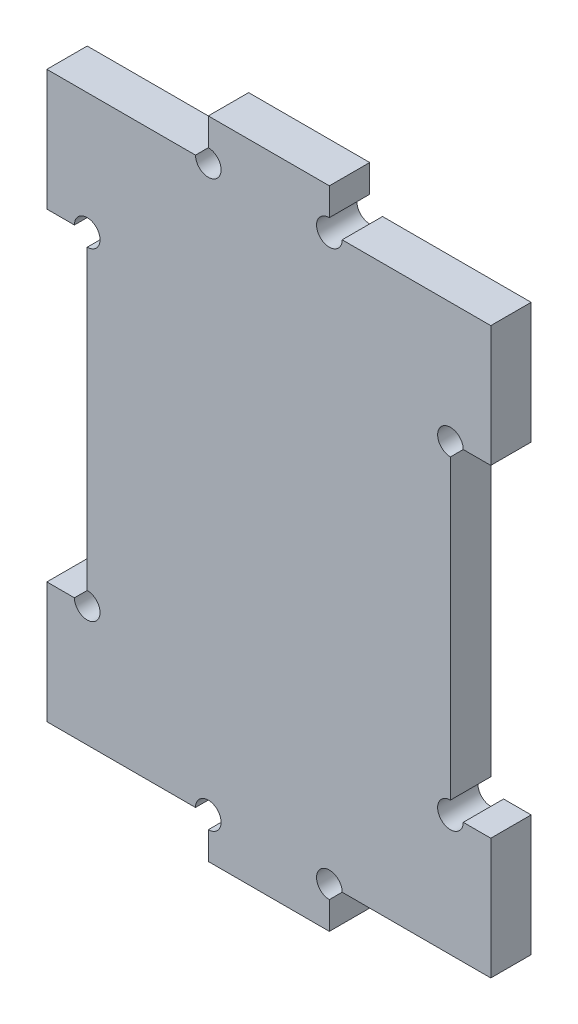
ISO-10303-21;
HEADER;
FILE_DESCRIPTION(('STEP AP214'),'2;1');
FILE_NAME('part.step','',(''),(''),'','','');
FILE_SCHEMA(('AUTOMOTIVE_DESIGN { 1 0 10303 214 1 1 1 1 }'));
ENDSEC;
DATA;
#1=APPLICATION_CONTEXT('core data for automotive mechanical design processes');
#2=APPLICATION_PROTOCOL_DEFINITION('international standard','automotive_design',2000,#1);
#3=PRODUCT_CONTEXT('',#1,'mechanical');
#4=PRODUCT('Part','Part','',(#3));
#5=PRODUCT_RELATED_PRODUCT_CATEGORY('part','',(#4));
#6=PRODUCT_DEFINITION_FORMATION('','',#4);
#7=PRODUCT_DEFINITION_CONTEXT('part definition',#1,'design');
#8=PRODUCT_DEFINITION('design','',#6,#7);
#9=PRODUCT_DEFINITION_SHAPE('','',#8);
#10=(LENGTH_UNIT() NAMED_UNIT(*) SI_UNIT(.MILLI.,.METRE.));
#11=(NAMED_UNIT(*) PLANE_ANGLE_UNIT() SI_UNIT($,.RADIAN.));
#12=(NAMED_UNIT(*) SI_UNIT($,.STERADIAN.) SOLID_ANGLE_UNIT());
#13=UNCERTAINTY_MEASURE_WITH_UNIT(LENGTH_MEASURE(1.E-05),#10,'distance_accuracy_value','');
#14=(GEOMETRIC_REPRESENTATION_CONTEXT(3) GLOBAL_UNCERTAINTY_ASSIGNED_CONTEXT((#13)) GLOBAL_UNIT_ASSIGNED_CONTEXT((#10,
#11,#12)) REPRESENTATION_CONTEXT('',''));
#15=CARTESIAN_POINT('',(0.,0.,0.));
#16=DIRECTION('',(0.,0.,1.));
#17=DIRECTION('',(1.,0.,0.));
#18=AXIS2_PLACEMENT_3D('',#15,#16,#17);
#19=CARTESIAN_POINT('',(27.5,35.,5.));
#20=DIRECTION('',(-1.,0.,0.));
#21=DIRECTION('',(0.,0.,1.));
#22=AXIS2_PLACEMENT_3D('',#19,#20,#21);
#23=PLANE('',#22);
#24=DIRECTION('',(0.,0.,1.));
#25=VECTOR('',#24,1.);
#26=CARTESIAN_POINT('',(27.5,-20.,0.));
#27=LINE('',#26,#25);
#28=CARTESIAN_POINT('',(27.5,-20.,0.));
#29=VERTEX_POINT('',#28);
#30=CARTESIAN_POINT('',(27.5,-20.,5.));
#31=VERTEX_POINT('',#30);
#32=EDGE_CURVE('E270',#29,#31,#27,.T.);
#33=ORIENTED_EDGE('',*,*,#32,.T.);
#34=DIRECTION('',(0.,1.,0.));
#35=VECTOR('',#34,1.);
#36=CARTESIAN_POINT('',(27.5,35.,5.));
#37=LINE('',#36,#35);
#38=CARTESIAN_POINT('',(27.5,-35.,5.));
#39=VERTEX_POINT('',#38);
#40=EDGE_CURVE('E343',#39,#31,#37,.T.);
#41=ORIENTED_EDGE('',*,*,#40,.F.);
#42=DIRECTION('',(0.,0.,-1.));
#43=VECTOR('',#42,1.);
#44=CARTESIAN_POINT('',(27.5,-35.,5.));
#45=LINE('',#44,#43);
#46=CARTESIAN_POINT('',(27.5,-35.,0.));
#47=VERTEX_POINT('',#46);
#48=EDGE_CURVE('E397',#39,#47,#45,.T.);
#49=ORIENTED_EDGE('',*,*,#48,.T.);
#50=DIRECTION('',(0.,1.,0.));
#51=VECTOR('',#50,1.);
#52=CARTESIAN_POINT('',(27.5,35.,0.));
#53=LINE('',#52,#51);
#54=EDGE_CURVE('E387',#47,#29,#53,.T.);
#55=ORIENTED_EDGE('',*,*,#54,.T.);
#56=EDGE_LOOP('',(#33,#41,#49,#55));
#57=FACE_BOUND('',#56,.T.);
#58=ADVANCED_FACE('F38',(#57),#23,.F.);
#59=DIRECTION('',(0.,0.,1.));
#60=VECTOR('',#59,1.);
#61=CARTESIAN_POINT('',(27.5,20.,0.));
#62=LINE('',#61,#60);
#63=CARTESIAN_POINT('',(27.5,20.,0.));
#64=VERTEX_POINT('',#63);
#65=CARTESIAN_POINT('',(27.5,20.,5.));
#66=VERTEX_POINT('',#65);
#67=EDGE_CURVE('E250',#64,#66,#62,.T.);
#68=ORIENTED_EDGE('',*,*,#67,.F.);
#69=CARTESIAN_POINT('',(27.5,35.,0.));
#70=VERTEX_POINT('',#69);
#71=EDGE_CURVE('E386',#64,#70,#53,.T.);
#72=ORIENTED_EDGE('',*,*,#71,.T.);
#73=DIRECTION('',(0.,0.,-1.));
#74=VECTOR('',#73,1.);
#75=CARTESIAN_POINT('',(27.5,35.,5.));
#76=LINE('',#75,#74);
#77=CARTESIAN_POINT('',(27.5,35.,5.));
#78=VERTEX_POINT('',#77);
#79=EDGE_CURVE('E351',#78,#70,#76,.T.);
#80=ORIENTED_EDGE('',*,*,#79,.F.);
#81=EDGE_CURVE('E342',#66,#78,#37,.T.);
#82=ORIENTED_EDGE('',*,*,#81,.F.);
#83=EDGE_LOOP('',(#68,#72,#80,#82));
#84=FACE_BOUND('',#83,.T.);
#85=ADVANCED_FACE('F572',(#84),#23,.F.);
#86=CARTESIAN_POINT('',(0.,0.,5.));
#87=DIRECTION('',(0.,0.,1.));
#88=DIRECTION('',(1.,0.,0.));
#89=AXIS2_PLACEMENT_3D('',#86,#87,#88);
#90=PLANE('',#89);
#91=CARTESIAN_POINT('',(-7.5,35.,5.));
#92=DIRECTION('',(0.,0.,1.));
#93=DIRECTION('',(1.,0.,0.));
#94=AXIS2_PLACEMENT_3D('',#91,#92,#93);
#95=CIRCLE('',#94,1.5875);
#96=CARTESIAN_POINT('',(-9.0875,35.,5.));
#97=VERTEX_POINT('',#96);
#98=CARTESIAN_POINT('',(-7.5,36.5875,5.));
#99=VERTEX_POINT('',#98);
#100=EDGE_CURVE('E486',#97,#99,#95,.T.);
#101=ORIENTED_EDGE('',*,*,#100,.F.);
#102=DIRECTION('',(-1.,0.,0.));
#103=VECTOR('',#102,1.);
#104=CARTESIAN_POINT('',(-7.5,35.,5.));
#105=LINE('',#104,#103);
#106=CARTESIAN_POINT('',(-27.5,35.,5.));
#107=VERTEX_POINT('',#106);
#108=EDGE_CURVE('E317',#97,#107,#105,.T.);
#109=ORIENTED_EDGE('',*,*,#108,.T.);
#110=DIRECTION('',(0.,-1.,0.));
#111=VECTOR('',#110,1.);
#112=CARTESIAN_POINT('',(-27.5,35.,5.));
#113=LINE('',#112,#111);
#114=CARTESIAN_POINT('',(-27.5,20.,5.));
#115=VERTEX_POINT('',#114);
#116=EDGE_CURVE('E321',#107,#115,#113,.T.);
#117=ORIENTED_EDGE('',*,*,#116,.T.);
#118=DIRECTION('',(-1.,0.,0.));
#119=VECTOR('',#118,1.);
#120=CARTESIAN_POINT('',(-22.5,20.,5.));
#121=LINE('',#120,#119);
#122=CARTESIAN_POINT('',(-24.0875,20.,5.));
#123=VERTEX_POINT('',#122);
#124=EDGE_CURVE('E282',#123,#115,#121,.T.);
#125=ORIENTED_EDGE('',*,*,#124,.F.);
#126=CARTESIAN_POINT('',(-22.5,20.,5.));
#127=DIRECTION('',(0.,0.,1.));
#128=DIRECTION('',(1.,0.,0.));
#129=AXIS2_PLACEMENT_3D('',#126,#127,#128);
#130=CIRCLE('',#129,1.5875);
#131=CARTESIAN_POINT('',(-22.5,18.4125,5.));
#132=VERTEX_POINT('',#131);
#133=EDGE_CURVE('E485',#132,#123,#130,.T.);
#134=ORIENTED_EDGE('',*,*,#133,.F.);
#135=DIRECTION('',(0.,1.,0.));
#136=VECTOR('',#135,1.);
#137=CARTESIAN_POINT('',(-22.5,-20.,5.));
#138=LINE('',#137,#136);
#139=CARTESIAN_POINT('',(-22.5,-18.4125,5.));
#140=VERTEX_POINT('',#139);
#141=EDGE_CURVE('E293',#140,#132,#138,.T.);
#142=ORIENTED_EDGE('',*,*,#141,.F.);
#143=CARTESIAN_POINT('',(-22.5,-20.,5.));
#144=DIRECTION('',(0.,0.,1.));
#145=DIRECTION('',(1.,0.,0.));
#146=AXIS2_PLACEMENT_3D('',#143,#144,#145);
#147=CIRCLE('',#146,1.5875);
#148=CARTESIAN_POINT('',(-24.0875,-20.,5.));
#149=VERTEX_POINT('',#148);
#150=EDGE_CURVE('E477',#149,#140,#147,.T.);
#151=ORIENTED_EDGE('',*,*,#150,.F.);
#152=DIRECTION('',(1.,0.,0.));
#153=VECTOR('',#152,1.);
#154=CARTESIAN_POINT('',(-22.5,-20.,5.));
#155=LINE('',#154,#153);
#156=CARTESIAN_POINT('',(-27.5,-20.,5.));
#157=VERTEX_POINT('',#156);
#158=EDGE_CURVE('E274',#157,#149,#155,.T.);
#159=ORIENTED_EDGE('',*,*,#158,.F.);
#160=CARTESIAN_POINT('',(-27.5,-35.,5.));
#161=VERTEX_POINT('',#160);
#162=EDGE_CURVE('E320',#157,#161,#113,.T.);
#163=ORIENTED_EDGE('',*,*,#162,.T.);
#164=DIRECTION('',(1.,0.,0.));
#165=VECTOR('',#164,1.);
#166=CARTESIAN_POINT('',(-7.5,-35.,5.));
#167=LINE('',#166,#165);
#168=CARTESIAN_POINT('',(-9.0875,-35.,5.));
#169=VERTEX_POINT('',#168);
#170=EDGE_CURVE('E325',#161,#169,#167,.T.);
#171=ORIENTED_EDGE('',*,*,#170,.T.);
#172=CARTESIAN_POINT('',(-7.5,-35.,5.));
#173=DIRECTION('',(0.,0.,1.));
#174=DIRECTION('',(1.,0.,0.));
#175=AXIS2_PLACEMENT_3D('',#172,#173,#174);
#176=CIRCLE('',#175,1.5875);
#177=CARTESIAN_POINT('',(-7.5,-36.5875,5.));
#178=VERTEX_POINT('',#177);
#179=EDGE_CURVE('E467',#178,#169,#176,.T.);
#180=ORIENTED_EDGE('',*,*,#179,.F.);
#181=DIRECTION('',(0.,-1.,0.));
#182=VECTOR('',#181,1.);
#183=CARTESIAN_POINT('',(-7.5,-40.,5.));
#184=LINE('',#183,#182);
#185=CARTESIAN_POINT('',(-7.5,-40.,5.));
#186=VERTEX_POINT('',#185);
#187=EDGE_CURVE('E329',#178,#186,#184,.T.);
#188=ORIENTED_EDGE('',*,*,#187,.T.);
#189=DIRECTION('',(1.,0.,0.));
#190=VECTOR('',#189,1.);
#191=CARTESIAN_POINT('',(-7.5,-40.,5.));
#192=LINE('',#191,#190);
#193=CARTESIAN_POINT('',(7.5,-40.,5.));
#194=VERTEX_POINT('',#193);
#195=EDGE_CURVE('E332',#186,#194,#192,.T.);
#196=ORIENTED_EDGE('',*,*,#195,.T.);
#197=DIRECTION('',(0.,1.,0.));
#198=VECTOR('',#197,1.);
#199=CARTESIAN_POINT('',(7.5,-40.,5.));
#200=LINE('',#199,#198);
#201=CARTESIAN_POINT('',(7.5,-36.5875,5.));
#202=VERTEX_POINT('',#201);
#203=EDGE_CURVE('E335',#194,#202,#200,.T.);
#204=ORIENTED_EDGE('',*,*,#203,.T.);
#205=CARTESIAN_POINT('',(7.5,-35.,5.));
#206=DIRECTION('',(0.,0.,1.));
#207=DIRECTION('',(1.,0.,0.));
#208=AXIS2_PLACEMENT_3D('',#205,#206,#207);
#209=CIRCLE('',#208,1.5875);
#210=CARTESIAN_POINT('',(9.0875,-35.,5.));
#211=VERTEX_POINT('',#210);
#212=EDGE_CURVE('E465',#211,#202,#209,.T.);
#213=ORIENTED_EDGE('',*,*,#212,.F.);
#214=DIRECTION('',(1.,0.,0.));
#215=VECTOR('',#214,1.);
#216=CARTESIAN_POINT('',(7.5,-35.,5.));
#217=LINE('',#216,#215);
#218=EDGE_CURVE('E339',#211,#39,#217,.T.);
#219=ORIENTED_EDGE('',*,*,#218,.T.);
#220=ORIENTED_EDGE('',*,*,#40,.T.);
#221=DIRECTION('',(-1.,0.,0.));
#222=VECTOR('',#221,1.);
#223=CARTESIAN_POINT('',(22.5,-20.,5.));
#224=LINE('',#223,#222);
#225=CARTESIAN_POINT('',(24.0875,-20.,5.));
#226=VERTEX_POINT('',#225);
#227=EDGE_CURVE('E257',#31,#226,#224,.T.);
#228=ORIENTED_EDGE('',*,*,#227,.T.);
#229=CARTESIAN_POINT('',(22.5,-20.,5.));
#230=DIRECTION('',(0.,0.,1.));
#231=DIRECTION('',(1.,0.,0.));
#232=AXIS2_PLACEMENT_3D('',#229,#230,#231);
#233=CIRCLE('',#232,1.5875);
#234=CARTESIAN_POINT('',(22.5,-18.4125,5.));
#235=VERTEX_POINT('',#234);
#236=EDGE_CURVE('E501',#235,#226,#233,.T.);
#237=ORIENTED_EDGE('',*,*,#236,.F.);
#238=DIRECTION('',(0.,1.,0.));
#239=VECTOR('',#238,1.);
#240=CARTESIAN_POINT('',(22.5,-20.,5.));
#241=LINE('',#240,#239);
#242=CARTESIAN_POINT('',(22.5,18.4125,5.));
#243=VERTEX_POINT('',#242);
#244=EDGE_CURVE('E244',#235,#243,#241,.T.);
#245=ORIENTED_EDGE('',*,*,#244,.T.);
#246=CARTESIAN_POINT('',(22.5,20.,5.));
#247=DIRECTION('',(0.,0.,1.));
#248=DIRECTION('',(1.,0.,0.));
#249=AXIS2_PLACEMENT_3D('',#246,#247,#248);
#250=CIRCLE('',#249,1.5875);
#251=CARTESIAN_POINT('',(24.0875,20.,5.));
#252=VERTEX_POINT('',#251);
#253=EDGE_CURVE('E225',#252,#243,#250,.T.);
#254=ORIENTED_EDGE('',*,*,#253,.F.);
#255=DIRECTION('',(1.,0.,0.));
#256=VECTOR('',#255,1.);
#257=CARTESIAN_POINT('',(22.5,20.,5.));
#258=LINE('',#257,#256);
#259=EDGE_CURVE('E240',#252,#66,#258,.T.);
#260=ORIENTED_EDGE('',*,*,#259,.T.);
#261=ORIENTED_EDGE('',*,*,#81,.T.);
#262=DIRECTION('',(-1.,0.,0.));
#263=VECTOR('',#262,1.);
#264=CARTESIAN_POINT('',(7.5,35.,5.));
#265=LINE('',#264,#263);
#266=CARTESIAN_POINT('',(9.0875,35.,5.));
#267=VERTEX_POINT('',#266);
#268=EDGE_CURVE('E347',#78,#267,#265,.T.);
#269=ORIENTED_EDGE('',*,*,#268,.T.);
#270=CARTESIAN_POINT('',(7.5,35.,5.));
#271=DIRECTION('',(0.,0.,1.));
#272=DIRECTION('',(1.,0.,0.));
#273=AXIS2_PLACEMENT_3D('',#270,#271,#272);
#274=CIRCLE('',#273,1.5875);
#275=CARTESIAN_POINT('',(7.5,36.5875,5.));
#276=VERTEX_POINT('',#275);
#277=EDGE_CURVE('E493',#276,#267,#274,.T.);
#278=ORIENTED_EDGE('',*,*,#277,.F.);
#279=DIRECTION('',(0.,1.,0.));
#280=VECTOR('',#279,1.);
#281=CARTESIAN_POINT('',(7.5,40.,5.));
#282=LINE('',#281,#280);
#283=CARTESIAN_POINT('',(7.5,40.,5.));
#284=VERTEX_POINT('',#283);
#285=EDGE_CURVE('E306',#276,#284,#282,.T.);
#286=ORIENTED_EDGE('',*,*,#285,.T.);
#287=DIRECTION('',(-1.,0.,0.));
#288=VECTOR('',#287,1.);
#289=CARTESIAN_POINT('',(-7.5,40.,5.));
#290=LINE('',#289,#288);
#291=CARTESIAN_POINT('',(-7.5,40.,5.));
#292=VERTEX_POINT('',#291);
#293=EDGE_CURVE('E309',#284,#292,#290,.T.);
#294=ORIENTED_EDGE('',*,*,#293,.T.);
#295=DIRECTION('',(0.,-1.,0.));
#296=VECTOR('',#295,1.);
#297=CARTESIAN_POINT('',(-7.5,40.,5.));
#298=LINE('',#297,#296);
#299=EDGE_CURVE('E313',#292,#99,#298,.T.);
#300=ORIENTED_EDGE('',*,*,#299,.T.);
#301=EDGE_LOOP('',(#101,#109,#117,#125,#134,#142,#151,#159,#163,#171,#180,#188,#196,#204,#213,
#219,#220,#228,#237,#245,#254,#260,#261,#269,#278,#286,#294,#300));
#302=FACE_BOUND('',#301,.T.);
#303=ADVANCED_FACE('F239',(#302),#90,.T.);
#304=CARTESIAN_POINT('',(0.,0.,0.));
#305=DIRECTION('',(0.,0.,1.));
#306=DIRECTION('',(1.,0.,0.));
#307=AXIS2_PLACEMENT_3D('',#304,#305,#306);
#308=PLANE('',#307);
#309=DIRECTION('',(-1.,0.,0.));
#310=VECTOR('',#309,1.);
#311=CARTESIAN_POINT('',(-7.5,35.,0.));
#312=LINE('',#311,#310);
#313=CARTESIAN_POINT('',(-9.0875,35.,0.));
#314=VERTEX_POINT('',#313);
#315=CARTESIAN_POINT('',(-27.5,35.,0.));
#316=VERTEX_POINT('',#315);
#317=EDGE_CURVE('E361',#314,#316,#312,.T.);
#318=ORIENTED_EDGE('',*,*,#317,.F.);
#319=CARTESIAN_POINT('',(-7.5,35.,0.));
#320=DIRECTION('',(0.,0.,1.));
#321=DIRECTION('',(1.,0.,0.));
#322=AXIS2_PLACEMENT_3D('',#319,#320,#321);
#323=CIRCLE('',#322,1.5875);
#324=CARTESIAN_POINT('',(-7.5,36.5875,0.));
#325=VERTEX_POINT('',#324);
#326=EDGE_CURVE('E54',#314,#325,#323,.T.);
#327=ORIENTED_EDGE('',*,*,#326,.T.);
#328=DIRECTION('',(0.,-1.,0.));
#329=VECTOR('',#328,1.);
#330=CARTESIAN_POINT('',(-7.5,40.,0.));
#331=LINE('',#330,#329);
#332=CARTESIAN_POINT('',(-7.5,40.,0.));
#333=VERTEX_POINT('',#332);
#334=EDGE_CURVE('E357',#333,#325,#331,.T.);
#335=ORIENTED_EDGE('',*,*,#334,.F.);
#336=DIRECTION('',(-1.,0.,0.));
#337=VECTOR('',#336,1.);
#338=CARTESIAN_POINT('',(-7.5,40.,0.));
#339=LINE('',#338,#337);
#340=CARTESIAN_POINT('',(7.5,40.,0.));
#341=VERTEX_POINT('',#340);
#342=EDGE_CURVE('E354',#341,#333,#339,.T.);
#343=ORIENTED_EDGE('',*,*,#342,.F.);
#344=DIRECTION('',(0.,1.,0.));
#345=VECTOR('',#344,1.);
#346=CARTESIAN_POINT('',(7.5,40.,0.));
#347=LINE('',#346,#345);
#348=CARTESIAN_POINT('',(7.5,36.5875,0.));
#349=VERTEX_POINT('',#348);
#350=EDGE_CURVE('E303',#349,#341,#347,.T.);
#351=ORIENTED_EDGE('',*,*,#350,.F.);
#352=CARTESIAN_POINT('',(7.5,35.,0.));
#353=DIRECTION('',(0.,0.,1.));
#354=DIRECTION('',(1.,0.,0.));
#355=AXIS2_PLACEMENT_3D('',#352,#353,#354);
#356=CIRCLE('',#355,1.5875);
#357=CARTESIAN_POINT('',(9.0875,35.,0.));
#358=VERTEX_POINT('',#357);
#359=EDGE_CURVE('E489',#349,#358,#356,.T.);
#360=ORIENTED_EDGE('',*,*,#359,.T.);
#361=DIRECTION('',(-1.,0.,0.));
#362=VECTOR('',#361,1.);
#363=CARTESIAN_POINT('',(7.5,35.,0.));
#364=LINE('',#363,#362);
#365=EDGE_CURVE('E310',#70,#358,#364,.T.);
#366=ORIENTED_EDGE('',*,*,#365,.F.);
#367=ORIENTED_EDGE('',*,*,#71,.F.);
#368=DIRECTION('',(1.,0.,0.));
#369=VECTOR('',#368,1.);
#370=CARTESIAN_POINT('',(22.5,20.,0.));
#371=LINE('',#370,#369);
#372=CARTESIAN_POINT('',(24.0875,20.,0.));
#373=VERTEX_POINT('',#372);
#374=EDGE_CURVE('E269',#373,#64,#371,.T.);
#375=ORIENTED_EDGE('',*,*,#374,.F.);
#376=CARTESIAN_POINT('',(22.5,20.,0.));
#377=DIRECTION('',(0.,0.,1.));
#378=DIRECTION('',(1.,0.,0.));
#379=AXIS2_PLACEMENT_3D('',#376,#377,#378);
#380=CIRCLE('',#379,1.5875);
#381=CARTESIAN_POINT('',(22.5,18.4125,0.));
#382=VERTEX_POINT('',#381);
#383=EDGE_CURVE('E228',#373,#382,#380,.T.);
#384=ORIENTED_EDGE('',*,*,#383,.T.);
#385=DIRECTION('',(0.,1.,0.));
#386=VECTOR('',#385,1.);
#387=CARTESIAN_POINT('',(22.5,-20.,0.));
#388=LINE('',#387,#386);
#389=CARTESIAN_POINT('',(22.5,-18.4125,0.));
#390=VERTEX_POINT('',#389);
#391=EDGE_CURVE('E534',#390,#382,#388,.T.);
#392=ORIENTED_EDGE('',*,*,#391,.F.);
#393=CARTESIAN_POINT('',(22.5,-20.,0.));
#394=DIRECTION('',(0.,0.,1.));
#395=DIRECTION('',(1.,0.,0.));
#396=AXIS2_PLACEMENT_3D('',#393,#394,#395);
#397=CIRCLE('',#396,1.5875);
#398=CARTESIAN_POINT('',(24.0875,-20.,0.));
#399=VERTEX_POINT('',#398);
#400=EDGE_CURVE('E246',#390,#399,#397,.T.);
#401=ORIENTED_EDGE('',*,*,#400,.T.);
#402=DIRECTION('',(-1.,0.,0.));
#403=VECTOR('',#402,1.);
#404=CARTESIAN_POINT('',(22.5,-20.,0.));
#405=LINE('',#404,#403);
#406=EDGE_CURVE('E263',#29,#399,#405,.T.);
#407=ORIENTED_EDGE('',*,*,#406,.F.);
#408=ORIENTED_EDGE('',*,*,#54,.F.);
#409=DIRECTION('',(1.,0.,0.));
#410=VECTOR('',#409,1.);
#411=CARTESIAN_POINT('',(7.5,-35.,0.));
#412=LINE('',#411,#410);
#413=CARTESIAN_POINT('',(9.0875,-35.,0.));
#414=VERTEX_POINT('',#413);
#415=EDGE_CURVE('E383',#414,#47,#412,.T.);
#416=ORIENTED_EDGE('',*,*,#415,.F.);
#417=CARTESIAN_POINT('',(7.5,-35.,0.));
#418=DIRECTION('',(0.,0.,1.));
#419=DIRECTION('',(1.,0.,0.));
#420=AXIS2_PLACEMENT_3D('',#417,#418,#419);
#421=CIRCLE('',#420,1.5875);
#422=CARTESIAN_POINT('',(7.5,-36.5875,0.));
#423=VERTEX_POINT('',#422);
#424=EDGE_CURVE('E504',#414,#423,#421,.T.);
#425=ORIENTED_EDGE('',*,*,#424,.T.);
#426=DIRECTION('',(0.,1.,0.));
#427=VECTOR('',#426,1.);
#428=CARTESIAN_POINT('',(7.5,-40.,0.));
#429=LINE('',#428,#427);
#430=CARTESIAN_POINT('',(7.5,-40.,0.));
#431=VERTEX_POINT('',#430);
#432=EDGE_CURVE('E379',#431,#423,#429,.T.);
#433=ORIENTED_EDGE('',*,*,#432,.F.);
#434=DIRECTION('',(1.,0.,0.));
#435=VECTOR('',#434,1.);
#436=CARTESIAN_POINT('',(-7.5,-40.,0.));
#437=LINE('',#436,#435);
#438=CARTESIAN_POINT('',(-7.5,-40.,0.));
#439=VERTEX_POINT('',#438);
#440=EDGE_CURVE('E376',#439,#431,#437,.T.);
#441=ORIENTED_EDGE('',*,*,#440,.F.);
#442=DIRECTION('',(0.,-1.,0.));
#443=VECTOR('',#442,1.);
#444=CARTESIAN_POINT('',(-7.5,-40.,0.));
#445=LINE('',#444,#443);
#446=CARTESIAN_POINT('',(-7.5,-36.5875,0.));
#447=VERTEX_POINT('',#446);
#448=EDGE_CURVE('E373',#447,#439,#445,.T.);
#449=ORIENTED_EDGE('',*,*,#448,.F.);
#450=CARTESIAN_POINT('',(-7.5,-35.,0.));
#451=DIRECTION('',(0.,0.,1.));
#452=DIRECTION('',(1.,0.,0.));
#453=AXIS2_PLACEMENT_3D('',#450,#451,#452);
#454=CIRCLE('',#453,1.5875);
#455=CARTESIAN_POINT('',(-9.0875,-35.,0.));
#456=VERTEX_POINT('',#455);
#457=EDGE_CURVE('E61',#447,#456,#454,.T.);
#458=ORIENTED_EDGE('',*,*,#457,.T.);
#459=DIRECTION('',(1.,0.,0.));
#460=VECTOR('',#459,1.);
#461=CARTESIAN_POINT('',(-7.5,-35.,0.));
#462=LINE('',#461,#460);
#463=CARTESIAN_POINT('',(-27.5,-35.,0.));
#464=VERTEX_POINT('',#463);
#465=EDGE_CURVE('E369',#464,#456,#462,.T.);
#466=ORIENTED_EDGE('',*,*,#465,.F.);
#467=DIRECTION('',(0.,-1.,0.));
#468=VECTOR('',#467,1.);
#469=CARTESIAN_POINT('',(-27.5,35.,0.));
#470=LINE('',#469,#468);
#471=CARTESIAN_POINT('',(-27.5,-20.,0.));
#472=VERTEX_POINT('',#471);
#473=EDGE_CURVE('E364',#472,#464,#470,.T.);
#474=ORIENTED_EDGE('',*,*,#473,.F.);
#475=DIRECTION('',(1.,0.,0.));
#476=VECTOR('',#475,1.);
#477=CARTESIAN_POINT('',(-22.5,-20.,0.));
#478=LINE('',#477,#476);
#479=CARTESIAN_POINT('',(-24.0875,-20.,0.));
#480=VERTEX_POINT('',#479);
#481=EDGE_CURVE('E277',#472,#480,#478,.T.);
#482=ORIENTED_EDGE('',*,*,#481,.T.);
#483=CARTESIAN_POINT('',(-22.5,-20.,0.));
#484=DIRECTION('',(0.,0.,1.));
#485=DIRECTION('',(1.,0.,0.));
#486=AXIS2_PLACEMENT_3D('',#483,#484,#485);
#487=CIRCLE('',#486,1.5875);
#488=CARTESIAN_POINT('',(-22.5,-18.4125,0.));
#489=VERTEX_POINT('',#488);
#490=EDGE_CURVE('E471',#480,#489,#487,.T.);
#491=ORIENTED_EDGE('',*,*,#490,.T.);
#492=DIRECTION('',(0.,1.,0.));
#493=VECTOR('',#492,1.);
#494=CARTESIAN_POINT('',(-22.5,-20.,0.));
#495=LINE('',#494,#493);
#496=CARTESIAN_POINT('',(-22.5,18.4125,0.));
#497=VERTEX_POINT('',#496);
#498=EDGE_CURVE('E281',#489,#497,#495,.T.);
#499=ORIENTED_EDGE('',*,*,#498,.T.);
#500=CARTESIAN_POINT('',(-22.5,20.,0.));
#501=DIRECTION('',(0.,0.,1.));
#502=DIRECTION('',(1.,0.,0.));
#503=AXIS2_PLACEMENT_3D('',#500,#501,#502);
#504=CIRCLE('',#503,1.5875);
#505=CARTESIAN_POINT('',(-24.0875,20.,0.));
#506=VERTEX_POINT('',#505);
#507=EDGE_CURVE('E505',#497,#506,#504,.T.);
#508=ORIENTED_EDGE('',*,*,#507,.T.);
#509=DIRECTION('',(-1.,0.,0.));
#510=VECTOR('',#509,1.);
#511=CARTESIAN_POINT('',(-22.5,20.,0.));
#512=LINE('',#511,#510);
#513=CARTESIAN_POINT('',(-27.5,20.,0.));
#514=VERTEX_POINT('',#513);
#515=EDGE_CURVE('E286',#506,#514,#512,.T.);
#516=ORIENTED_EDGE('',*,*,#515,.T.);
#517=EDGE_CURVE('E365',#316,#514,#470,.T.);
#518=ORIENTED_EDGE('',*,*,#517,.F.);
#519=EDGE_LOOP('',(#318,#327,#335,#343,#351,#360,#366,#367,#375,#384,#392,#401,#407,#408,#416,
#425,#433,#441,#449,#458,#466,#474,#482,#491,#499,#508,#516,#518));
#520=FACE_BOUND('',#519,.T.);
#521=ADVANCED_FACE('F451',(#520),#308,.F.);
#522=CARTESIAN_POINT('',(-27.5,35.,5.));
#523=DIRECTION('',(1.,0.,0.));
#524=DIRECTION('',(0.,0.,-1.));
#525=AXIS2_PLACEMENT_3D('',#522,#523,#524);
#526=PLANE('',#525);
#527=ORIENTED_EDGE('',*,*,#517,.T.);
#528=DIRECTION('',(0.,0.,1.));
#529=VECTOR('',#528,1.);
#530=CARTESIAN_POINT('',(-27.5,20.,0.));
#531=LINE('',#530,#529);
#532=EDGE_CURVE('E299',#514,#115,#531,.T.);
#533=ORIENTED_EDGE('',*,*,#532,.T.);
#534=ORIENTED_EDGE('',*,*,#116,.F.);
#535=DIRECTION('',(0.,0.,-1.));
#536=VECTOR('',#535,1.);
#537=CARTESIAN_POINT('',(-27.5,35.,5.));
#538=LINE('',#537,#536);
#539=EDGE_CURVE('E413',#107,#316,#538,.T.);
#540=ORIENTED_EDGE('',*,*,#539,.T.);
#541=EDGE_LOOP('',(#527,#533,#534,#540));
#542=FACE_BOUND('',#541,.T.);
#543=ADVANCED_FACE('F599',(#542),#526,.F.);
#544=CARTESIAN_POINT('',(7.5,40.,5.));
#545=DIRECTION('',(-1.,0.,0.));
#546=DIRECTION('',(0.,-1.,0.));
#547=AXIS2_PLACEMENT_3D('',#544,#545,#546);
#548=PLANE('',#547);
#549=ORIENTED_EDGE('',*,*,#285,.F.);
#550=DIRECTION('',(0.,0.,1.));
#551=VECTOR('',#550,1.);
#552=CARTESIAN_POINT('',(7.5,36.5875,0.));
#553=LINE('',#552,#551);
#554=EDGE_CURVE('E525',#276,#349,#553,.F.);
#555=ORIENTED_EDGE('',*,*,#554,.T.);
#556=ORIENTED_EDGE('',*,*,#350,.T.);
#557=DIRECTION('',(0.,0.,-1.));
#558=VECTOR('',#557,1.);
#559=CARTESIAN_POINT('',(7.5,40.,5.));
#560=LINE('',#559,#558);
#561=EDGE_CURVE('E234',#284,#341,#560,.T.);
#562=ORIENTED_EDGE('',*,*,#561,.F.);
#563=EDGE_LOOP('',(#549,#555,#556,#562));
#564=FACE_BOUND('',#563,.T.);
#565=ADVANCED_FACE('F40',(#564),#548,.F.);
#566=CARTESIAN_POINT('',(-7.5,40.,5.));
#567=DIRECTION('',(0.,-1.,0.));
#568=DIRECTION('',(0.,0.,-1.));
#569=AXIS2_PLACEMENT_3D('',#566,#567,#568);
#570=PLANE('',#569);
#571=ORIENTED_EDGE('',*,*,#342,.T.);
#572=DIRECTION('',(0.,0.,-1.));
#573=VECTOR('',#572,1.);
#574=CARTESIAN_POINT('',(-7.5,40.,5.));
#575=LINE('',#574,#573);
#576=EDGE_CURVE('E417',#292,#333,#575,.T.);
#577=ORIENTED_EDGE('',*,*,#576,.F.);
#578=ORIENTED_EDGE('',*,*,#293,.F.);
#579=ORIENTED_EDGE('',*,*,#561,.T.);
#580=EDGE_LOOP('',(#571,#577,#578,#579));
#581=FACE_BOUND('',#580,.T.);
#582=ADVANCED_FACE('F605',(#581),#570,.F.);
#583=CARTESIAN_POINT('',(-7.5,40.,5.));
#584=DIRECTION('',(1.,0.,0.));
#585=DIRECTION('',(0.,1.,0.));
#586=AXIS2_PLACEMENT_3D('',#583,#584,#585);
#587=PLANE('',#586);
#588=ORIENTED_EDGE('',*,*,#334,.T.);
#589=DIRECTION('',(0.,0.,1.));
#590=VECTOR('',#589,1.);
#591=CARTESIAN_POINT('',(-7.5,36.5875,0.));
#592=LINE('',#591,#590);
#593=EDGE_CURVE('E253',#325,#99,#592,.T.);
#594=ORIENTED_EDGE('',*,*,#593,.T.);
#595=ORIENTED_EDGE('',*,*,#299,.F.);
#596=ORIENTED_EDGE('',*,*,#576,.T.);
#597=EDGE_LOOP('',(#588,#594,#595,#596));
#598=FACE_BOUND('',#597,.T.);
#599=ADVANCED_FACE('F602',(#598),#587,.F.);
#600=CARTESIAN_POINT('',(-7.5,35.,5.));
#601=DIRECTION('',(0.,-1.,0.));
#602=DIRECTION('',(1.,0.,0.));
#603=AXIS2_PLACEMENT_3D('',#600,#601,#602);
#604=PLANE('',#603);
#605=ORIENTED_EDGE('',*,*,#108,.F.);
#606=DIRECTION('',(0.,0.,1.));
#607=VECTOR('',#606,1.);
#608=CARTESIAN_POINT('',(-9.0875,35.,0.));
#609=LINE('',#608,#607);
#610=EDGE_CURVE('E11',#97,#314,#609,.F.);
#611=ORIENTED_EDGE('',*,*,#610,.T.);
#612=ORIENTED_EDGE('',*,*,#317,.T.);
#613=ORIENTED_EDGE('',*,*,#539,.F.);
#614=EDGE_LOOP('',(#605,#611,#612,#613));
#615=FACE_BOUND('',#614,.T.);
#616=ADVANCED_FACE('F597',(#615),#604,.F.);
#617=ORIENTED_EDGE('',*,*,#162,.F.);
#618=DIRECTION('',(0.,0.,1.));
#619=VECTOR('',#618,1.);
#620=CARTESIAN_POINT('',(-27.5,-20.,0.));
#621=LINE('',#620,#619);
#622=EDGE_CURVE('E289',#472,#157,#621,.T.);
#623=ORIENTED_EDGE('',*,*,#622,.F.);
#624=ORIENTED_EDGE('',*,*,#473,.T.);
#625=DIRECTION('',(0.,0.,-1.));
#626=VECTOR('',#625,1.);
#627=CARTESIAN_POINT('',(-27.5,-35.,5.));
#628=LINE('',#627,#626);
#629=EDGE_CURVE('E409',#161,#464,#628,.T.);
#630=ORIENTED_EDGE('',*,*,#629,.F.);
#631=EDGE_LOOP('',(#617,#623,#624,#630));
#632=FACE_BOUND('',#631,.T.);
#633=ADVANCED_FACE('F593',(#632),#526,.F.);
#634=CARTESIAN_POINT('',(-7.5,-35.,5.));
#635=DIRECTION('',(0.,1.,0.));
#636=DIRECTION('',(-1.,0.,0.));
#637=AXIS2_PLACEMENT_3D('',#634,#635,#636);
#638=PLANE('',#637);
#639=ORIENTED_EDGE('',*,*,#465,.T.);
#640=DIRECTION('',(0.,0.,1.));
#641=VECTOR('',#640,1.);
#642=CARTESIAN_POINT('',(-9.0875,-35.,0.));
#643=LINE('',#642,#641);
#644=EDGE_CURVE('E260',#456,#169,#643,.T.);
#645=ORIENTED_EDGE('',*,*,#644,.T.);
#646=ORIENTED_EDGE('',*,*,#170,.F.);
#647=ORIENTED_EDGE('',*,*,#629,.T.);
#648=EDGE_LOOP('',(#639,#645,#646,#647));
#649=FACE_BOUND('',#648,.T.);
#650=ADVANCED_FACE('F590',(#649),#638,.F.);
#651=CARTESIAN_POINT('',(-7.5,-40.,5.));
#652=DIRECTION('',(1.,0.,0.));
#653=DIRECTION('',(0.,1.,0.));
#654=AXIS2_PLACEMENT_3D('',#651,#652,#653);
#655=PLANE('',#654);
#656=ORIENTED_EDGE('',*,*,#187,.F.);
#657=DIRECTION('',(0.,0.,1.));
#658=VECTOR('',#657,1.);
#659=CARTESIAN_POINT('',(-7.5,-36.5875,0.));
#660=LINE('',#659,#658);
#661=EDGE_CURVE('E47',#178,#447,#660,.F.);
#662=ORIENTED_EDGE('',*,*,#661,.T.);
#663=ORIENTED_EDGE('',*,*,#448,.T.);
#664=DIRECTION('',(0.,0.,-1.));
#665=VECTOR('',#664,1.);
#666=CARTESIAN_POINT('',(-7.5,-40.,5.));
#667=LINE('',#666,#665);
#668=EDGE_CURVE('E405',#186,#439,#667,.T.);
#669=ORIENTED_EDGE('',*,*,#668,.F.);
#670=EDGE_LOOP('',(#656,#662,#663,#669));
#671=FACE_BOUND('',#670,.T.);
#672=ADVANCED_FACE('F445',(#671),#655,.F.);
#673=CARTESIAN_POINT('',(-7.5,-40.,5.));
#674=DIRECTION('',(0.,1.,0.));
#675=DIRECTION('',(0.,0.,1.));
#676=AXIS2_PLACEMENT_3D('',#673,#674,#675);
#677=PLANE('',#676);
#678=ORIENTED_EDGE('',*,*,#440,.T.);
#679=DIRECTION('',(0.,0.,-1.));
#680=VECTOR('',#679,1.);
#681=CARTESIAN_POINT('',(7.5,-40.,5.));
#682=LINE('',#681,#680);
#683=EDGE_CURVE('E401',#194,#431,#682,.T.);
#684=ORIENTED_EDGE('',*,*,#683,.F.);
#685=ORIENTED_EDGE('',*,*,#195,.F.);
#686=ORIENTED_EDGE('',*,*,#668,.T.);
#687=EDGE_LOOP('',(#678,#684,#685,#686));
#688=FACE_BOUND('',#687,.T.);
#689=ADVANCED_FACE('F457',(#688),#677,.F.);
#690=CARTESIAN_POINT('',(7.5,-40.,5.));
#691=DIRECTION('',(-1.,0.,0.));
#692=DIRECTION('',(0.,-1.,0.));
#693=AXIS2_PLACEMENT_3D('',#690,#691,#692);
#694=PLANE('',#693);
#695=ORIENTED_EDGE('',*,*,#432,.T.);
#696=DIRECTION('',(0.,0.,1.));
#697=VECTOR('',#696,1.);
#698=CARTESIAN_POINT('',(7.5,-36.5875,0.));
#699=LINE('',#698,#697);
#700=EDGE_CURVE('E463',#423,#202,#699,.T.);
#701=ORIENTED_EDGE('',*,*,#700,.T.);
#702=ORIENTED_EDGE('',*,*,#203,.F.);
#703=ORIENTED_EDGE('',*,*,#683,.T.);
#704=EDGE_LOOP('',(#695,#701,#702,#703));
#705=FACE_BOUND('',#704,.T.);
#706=ADVANCED_FACE('F461',(#705),#694,.F.);
#707=CARTESIAN_POINT('',(7.5,-35.,5.));
#708=DIRECTION('',(0.,1.,0.));
#709=DIRECTION('',(-1.,0.,0.));
#710=AXIS2_PLACEMENT_3D('',#707,#708,#709);
#711=PLANE('',#710);
#712=ORIENTED_EDGE('',*,*,#218,.F.);
#713=DIRECTION('',(0.,0.,1.));
#714=VECTOR('',#713,1.);
#715=CARTESIAN_POINT('',(9.0875,-35.,0.));
#716=LINE('',#715,#714);
#717=EDGE_CURVE('E438',#211,#414,#716,.F.);
#718=ORIENTED_EDGE('',*,*,#717,.T.);
#719=ORIENTED_EDGE('',*,*,#415,.T.);
#720=ORIENTED_EDGE('',*,*,#48,.F.);
#721=EDGE_LOOP('',(#712,#718,#719,#720));
#722=FACE_BOUND('',#721,.T.);
#723=ADVANCED_FACE('F552',(#722),#711,.F.);
#724=CARTESIAN_POINT('',(7.5,35.,5.));
#725=DIRECTION('',(0.,-1.,0.));
#726=DIRECTION('',(1.,0.,0.));
#727=AXIS2_PLACEMENT_3D('',#724,#725,#726);
#728=PLANE('',#727);
#729=ORIENTED_EDGE('',*,*,#365,.T.);
#730=DIRECTION('',(0.,0.,1.));
#731=VECTOR('',#730,1.);
#732=CARTESIAN_POINT('',(9.0875,35.,0.));
#733=LINE('',#732,#731);
#734=EDGE_CURVE('E434',#358,#267,#733,.T.);
#735=ORIENTED_EDGE('',*,*,#734,.T.);
#736=ORIENTED_EDGE('',*,*,#268,.F.);
#737=ORIENTED_EDGE('',*,*,#79,.T.);
#738=EDGE_LOOP('',(#729,#735,#736,#737));
#739=FACE_BOUND('',#738,.T.);
#740=ADVANCED_FACE('F580',(#739),#728,.F.);
#741=CARTESIAN_POINT('',(-22.5,20.,0.));
#742=DIRECTION('',(0.,1.,0.));
#743=DIRECTION('',(0.,0.,1.));
#744=AXIS2_PLACEMENT_3D('',#741,#742,#743);
#745=PLANE('',#744);
#746=ORIENTED_EDGE('',*,*,#515,.F.);
#747=DIRECTION('',(0.,0.,1.));
#748=VECTOR('',#747,1.);
#749=CARTESIAN_POINT('',(-24.0875,20.,0.));
#750=LINE('',#749,#748);
#751=EDGE_CURVE('E521',#506,#123,#750,.T.);
#752=ORIENTED_EDGE('',*,*,#751,.T.);
#753=ORIENTED_EDGE('',*,*,#124,.T.);
#754=ORIENTED_EDGE('',*,*,#532,.F.);
#755=EDGE_LOOP('',(#746,#752,#753,#754));
#756=FACE_BOUND('',#755,.T.);
#757=ADVANCED_FACE('F654',(#756),#745,.F.);
#758=CARTESIAN_POINT('',(-22.5,-20.,0.));
#759=DIRECTION('',(1.,0.,0.));
#760=DIRECTION('',(0.,0.,-1.));
#761=AXIS2_PLACEMENT_3D('',#758,#759,#760);
#762=PLANE('',#761);
#763=ORIENTED_EDGE('',*,*,#498,.F.);
#764=DIRECTION('',(0.,0.,1.));
#765=VECTOR('',#764,1.);
#766=CARTESIAN_POINT('',(-22.5,-18.4125,0.));
#767=LINE('',#766,#765);
#768=EDGE_CURVE('E517',#489,#140,#767,.T.);
#769=ORIENTED_EDGE('',*,*,#768,.T.);
#770=ORIENTED_EDGE('',*,*,#141,.T.);
#771=DIRECTION('',(0.,0.,1.));
#772=VECTOR('',#771,1.);
#773=CARTESIAN_POINT('',(-22.5,18.4125,0.));
#774=LINE('',#773,#772);
#775=EDGE_CURVE('E430',#132,#497,#774,.F.);
#776=ORIENTED_EDGE('',*,*,#775,.T.);
#777=EDGE_LOOP('',(#763,#769,#770,#776));
#778=FACE_BOUND('',#777,.T.);
#779=ADVANCED_FACE('F657',(#778),#762,.F.);
#780=CARTESIAN_POINT('',(-22.5,-20.,0.));
#781=DIRECTION('',(0.,-1.,0.));
#782=DIRECTION('',(0.,0.,-1.));
#783=AXIS2_PLACEMENT_3D('',#780,#781,#782);
#784=PLANE('',#783);
#785=ORIENTED_EDGE('',*,*,#158,.T.);
#786=DIRECTION('',(0.,0.,1.));
#787=VECTOR('',#786,1.);
#788=CARTESIAN_POINT('',(-24.0875,-20.,0.));
#789=LINE('',#788,#787);
#790=EDGE_CURVE('E426',#149,#480,#789,.F.);
#791=ORIENTED_EDGE('',*,*,#790,.T.);
#792=ORIENTED_EDGE('',*,*,#481,.F.);
#793=ORIENTED_EDGE('',*,*,#622,.T.);
#794=EDGE_LOOP('',(#785,#791,#792,#793));
#795=FACE_BOUND('',#794,.T.);
#796=ADVANCED_FACE('F649',(#795),#784,.F.);
#797=CARTESIAN_POINT('',(22.5,-20.,0.));
#798=DIRECTION('',(0.,1.,0.));
#799=DIRECTION('',(0.,0.,1.));
#800=AXIS2_PLACEMENT_3D('',#797,#798,#799);
#801=PLANE('',#800);
#802=DIRECTION('',(0.,0.,1.));
#803=VECTOR('',#802,1.);
#804=CARTESIAN_POINT('',(24.0875,-20.,0.));
#805=LINE('',#804,#803);
#806=EDGE_CURVE('E514',#226,#399,#805,.F.);
#807=ORIENTED_EDGE('',*,*,#806,.F.);
#808=ORIENTED_EDGE('',*,*,#227,.F.);
#809=ORIENTED_EDGE('',*,*,#32,.F.);
#810=ORIENTED_EDGE('',*,*,#406,.T.);
#811=EDGE_LOOP('',(#807,#808,#809,#810));
#812=FACE_BOUND('',#811,.T.);
#813=ADVANCED_FACE('F545',(#812),#801,.T.);
#814=CARTESIAN_POINT('',(22.5,-20.,0.));
#815=DIRECTION('',(1.,0.,0.));
#816=DIRECTION('',(0.,0.,-1.));
#817=AXIS2_PLACEMENT_3D('',#814,#815,#816);
#818=PLANE('',#817);
#819=DIRECTION('',(0.,0.,1.));
#820=VECTOR('',#819,1.);
#821=CARTESIAN_POINT('',(22.5,18.4125,0.));
#822=LINE('',#821,#820);
#823=EDGE_CURVE('E509',#243,#382,#822,.F.);
#824=ORIENTED_EDGE('',*,*,#823,.F.);
#825=ORIENTED_EDGE('',*,*,#244,.F.);
#826=DIRECTION('',(0.,0.,1.));
#827=VECTOR('',#826,1.);
#828=CARTESIAN_POINT('',(22.5,-18.4125,0.));
#829=LINE('',#828,#827);
#830=EDGE_CURVE('E233',#390,#235,#829,.T.);
#831=ORIENTED_EDGE('',*,*,#830,.F.);
#832=ORIENTED_EDGE('',*,*,#391,.T.);
#833=EDGE_LOOP('',(#824,#825,#831,#832));
#834=FACE_BOUND('',#833,.T.);
#835=ADVANCED_FACE('F648',(#834),#818,.T.);
#836=CARTESIAN_POINT('',(22.5,20.,0.));
#837=DIRECTION('',(0.,-1.,0.));
#838=DIRECTION('',(0.,0.,-1.));
#839=AXIS2_PLACEMENT_3D('',#836,#837,#838);
#840=PLANE('',#839);
#841=DIRECTION('',(0.,0.,1.));
#842=VECTOR('',#841,1.);
#843=CARTESIAN_POINT('',(24.0875,20.,0.));
#844=LINE('',#843,#842);
#845=EDGE_CURVE('E222',#373,#252,#844,.T.);
#846=ORIENTED_EDGE('',*,*,#845,.F.);
#847=ORIENTED_EDGE('',*,*,#374,.T.);
#848=ORIENTED_EDGE('',*,*,#67,.T.);
#849=ORIENTED_EDGE('',*,*,#259,.F.);
#850=EDGE_LOOP('',(#846,#847,#848,#849));
#851=FACE_BOUND('',#850,.T.);
#852=ADVANCED_FACE('F248',(#851),#840,.T.);
#853=CARTESIAN_POINT('',(22.5,20.,0.));
#854=DIRECTION('',(0.,0.,1.));
#855=DIRECTION('',(1.,0.,0.));
#856=AXIS2_PLACEMENT_3D('',#853,#854,#855);
#857=CYLINDRICAL_SURFACE('',#856,1.5875);
#858=ORIENTED_EDGE('',*,*,#823,.T.);
#859=ORIENTED_EDGE('',*,*,#383,.F.);
#860=ORIENTED_EDGE('',*,*,#845,.T.);
#861=ORIENTED_EDGE('',*,*,#253,.T.);
#862=EDGE_LOOP('',(#858,#859,#860,#861));
#863=FACE_BOUND('',#862,.T.);
#864=ADVANCED_FACE('F224',(#863),#857,.F.);
#865=CARTESIAN_POINT('',(22.5,-20.,0.));
#866=DIRECTION('',(0.,0.,1.));
#867=DIRECTION('',(1.,0.,0.));
#868=AXIS2_PLACEMENT_3D('',#865,#866,#867);
#869=CYLINDRICAL_SURFACE('',#868,1.5875);
#870=ORIENTED_EDGE('',*,*,#806,.T.);
#871=ORIENTED_EDGE('',*,*,#400,.F.);
#872=ORIENTED_EDGE('',*,*,#830,.T.);
#873=ORIENTED_EDGE('',*,*,#236,.T.);
#874=EDGE_LOOP('',(#870,#871,#872,#873));
#875=FACE_BOUND('',#874,.T.);
#876=ADVANCED_FACE('F639',(#875),#869,.F.);
#877=CARTESIAN_POINT('',(-22.5,-20.,0.));
#878=DIRECTION('',(0.,0.,1.));
#879=DIRECTION('',(1.,0.,0.));
#880=AXIS2_PLACEMENT_3D('',#877,#878,#879);
#881=CYLINDRICAL_SURFACE('',#880,1.5875);
#882=ORIENTED_EDGE('',*,*,#490,.F.);
#883=ORIENTED_EDGE('',*,*,#790,.F.);
#884=ORIENTED_EDGE('',*,*,#150,.T.);
#885=ORIENTED_EDGE('',*,*,#768,.F.);
#886=EDGE_LOOP('',(#882,#883,#884,#885));
#887=FACE_BOUND('',#886,.T.);
#888=ADVANCED_FACE('F635',(#887),#881,.F.);
#889=CARTESIAN_POINT('',(-22.5,20.,0.));
#890=DIRECTION('',(0.,0.,1.));
#891=DIRECTION('',(1.,0.,0.));
#892=AXIS2_PLACEMENT_3D('',#889,#890,#891);
#893=CYLINDRICAL_SURFACE('',#892,1.5875);
#894=ORIENTED_EDGE('',*,*,#507,.F.);
#895=ORIENTED_EDGE('',*,*,#775,.F.);
#896=ORIENTED_EDGE('',*,*,#133,.T.);
#897=ORIENTED_EDGE('',*,*,#751,.F.);
#898=EDGE_LOOP('',(#894,#895,#896,#897));
#899=FACE_BOUND('',#898,.T.);
#900=ADVANCED_FACE('F568',(#899),#893,.F.);
#901=CARTESIAN_POINT('',(7.5,35.,0.));
#902=DIRECTION('',(0.,0.,1.));
#903=DIRECTION('',(1.,0.,0.));
#904=AXIS2_PLACEMENT_3D('',#901,#902,#903);
#905=CYLINDRICAL_SURFACE('',#904,1.5875);
#906=ORIENTED_EDGE('',*,*,#277,.T.);
#907=ORIENTED_EDGE('',*,*,#734,.F.);
#908=ORIENTED_EDGE('',*,*,#359,.F.);
#909=ORIENTED_EDGE('',*,*,#554,.F.);
#910=EDGE_LOOP('',(#906,#907,#908,#909));
#911=FACE_BOUND('',#910,.T.);
#912=ADVANCED_FACE('F560',(#911),#905,.F.);
#913=CARTESIAN_POINT('',(7.5,-35.,0.));
#914=DIRECTION('',(0.,0.,1.));
#915=DIRECTION('',(1.,0.,0.));
#916=AXIS2_PLACEMENT_3D('',#913,#914,#915);
#917=CYLINDRICAL_SURFACE('',#916,1.5875);
#918=ORIENTED_EDGE('',*,*,#424,.F.);
#919=ORIENTED_EDGE('',*,*,#717,.F.);
#920=ORIENTED_EDGE('',*,*,#212,.T.);
#921=ORIENTED_EDGE('',*,*,#700,.F.);
#922=EDGE_LOOP('',(#918,#919,#920,#921));
#923=FACE_BOUND('',#922,.T.);
#924=ADVANCED_FACE('F557',(#923),#917,.F.);
#925=CARTESIAN_POINT('',(-7.5,-35.,0.));
#926=DIRECTION('',(0.,0.,1.));
#927=DIRECTION('',(1.,0.,0.));
#928=AXIS2_PLACEMENT_3D('',#925,#926,#927);
#929=CYLINDRICAL_SURFACE('',#928,1.5875);
#930=ORIENTED_EDGE('',*,*,#457,.F.);
#931=ORIENTED_EDGE('',*,*,#661,.F.);
#932=ORIENTED_EDGE('',*,*,#179,.T.);
#933=ORIENTED_EDGE('',*,*,#644,.F.);
#934=EDGE_LOOP('',(#930,#931,#932,#933));
#935=FACE_BOUND('',#934,.T.);
#936=ADVANCED_FACE('F559',(#935),#929,.F.);
#937=CARTESIAN_POINT('',(-7.5,35.,0.));
#938=DIRECTION('',(0.,0.,1.));
#939=DIRECTION('',(1.,0.,0.));
#940=AXIS2_PLACEMENT_3D('',#937,#938,#939);
#941=CYLINDRICAL_SURFACE('',#940,1.5875);
#942=ORIENTED_EDGE('',*,*,#326,.F.);
#943=ORIENTED_EDGE('',*,*,#610,.F.);
#944=ORIENTED_EDGE('',*,*,#100,.T.);
#945=ORIENTED_EDGE('',*,*,#593,.F.);
#946=EDGE_LOOP('',(#942,#943,#944,#945));
#947=FACE_BOUND('',#946,.T.);
#948=ADVANCED_FACE('F566',(#947),#941,.F.);
#949=CLOSED_SHELL('',(#58,#85,#303,#521,#543,#565,#582,#599,#616,#633,#650,#672,#689,#706,#723,
#740,#757,#779,#796,#813,#835,#852,#864,#876,#888,#900,#912,#924,#936,#948));
#950=MANIFOLD_SOLID_BREP('B2',#949);
#951=ADVANCED_BREP_SHAPE_REPRESENTATION('',(#18,#950),#14);
#952=SHAPE_DEFINITION_REPRESENTATION(#9,#951);
ENDSEC;
END-ISO-10303-21;
